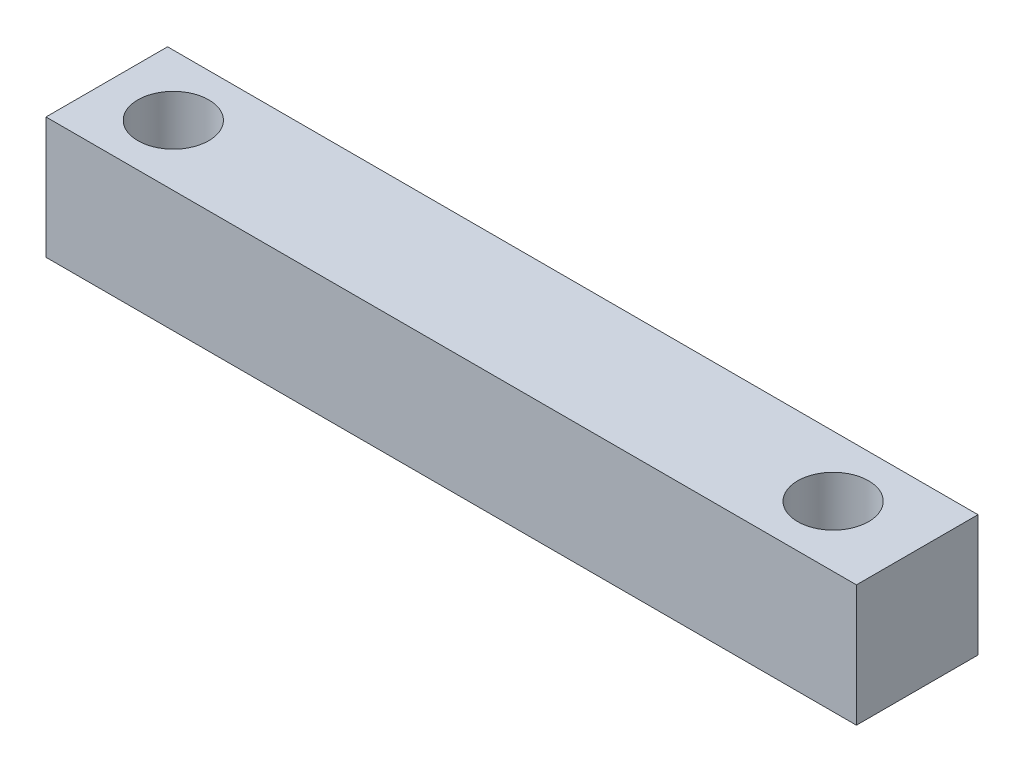
ISO-10303-21;
HEADER;
FILE_DESCRIPTION(('STEP AP214'),'2;1');
FILE_NAME('part.step','',(''),(''),'','','');
FILE_SCHEMA(('AUTOMOTIVE_DESIGN { 1 0 10303 214 1 1 1 1 }'));
ENDSEC;
DATA;
#1=APPLICATION_CONTEXT('core data for automotive mechanical design processes');
#2=APPLICATION_PROTOCOL_DEFINITION('international standard','automotive_design',2000,#1);
#3=PRODUCT_CONTEXT('',#1,'mechanical');
#4=PRODUCT('Part','Part','',(#3));
#5=PRODUCT_RELATED_PRODUCT_CATEGORY('part','',(#4));
#6=PRODUCT_DEFINITION_FORMATION('','',#4);
#7=PRODUCT_DEFINITION_CONTEXT('part definition',#1,'design');
#8=PRODUCT_DEFINITION('design','',#6,#7);
#9=PRODUCT_DEFINITION_SHAPE('','',#8);
#10=(LENGTH_UNIT() NAMED_UNIT(*) SI_UNIT(.MILLI.,.METRE.));
#11=(NAMED_UNIT(*) PLANE_ANGLE_UNIT() SI_UNIT($,.RADIAN.));
#12=(NAMED_UNIT(*) SI_UNIT($,.STERADIAN.) SOLID_ANGLE_UNIT());
#13=UNCERTAINTY_MEASURE_WITH_UNIT(LENGTH_MEASURE(1.E-05),#10,'distance_accuracy_value','');
#14=(GEOMETRIC_REPRESENTATION_CONTEXT(3) GLOBAL_UNCERTAINTY_ASSIGNED_CONTEXT((#13)) GLOBAL_UNIT_ASSIGNED_CONTEXT((#10,
#11,#12)) REPRESENTATION_CONTEXT('',''));
#15=CARTESIAN_POINT('',(0.,0.,0.));
#16=DIRECTION('',(0.,0.,1.));
#17=DIRECTION('',(1.,0.,0.));
#18=AXIS2_PLACEMENT_3D('',#15,#16,#17);
#19=CARTESIAN_POINT('',(0.,10.,0.));
#20=DIRECTION('',(1.,0.,0.));
#21=DIRECTION('',(0.,0.,-1.));
#22=AXIS2_PLACEMENT_3D('',#19,#20,#21);
#23=PLANE('',#22);
#24=DIRECTION('',(0.,0.,1.));
#25=VECTOR('',#24,1.);
#26=CARTESIAN_POINT('',(0.,0.,0.));
#27=LINE('',#26,#25);
#28=CARTESIAN_POINT('',(0.,0.,-6.));
#29=VERTEX_POINT('',#28);
#30=CARTESIAN_POINT('',(0.,0.,0.));
#31=VERTEX_POINT('',#30);
#32=EDGE_CURVE('E90',#29,#31,#27,.T.);
#33=ORIENTED_EDGE('',*,*,#32,.T.);
#34=DIRECTION('',(0.,-1.,0.));
#35=VECTOR('',#34,1.);
#36=CARTESIAN_POINT('',(0.,10.,0.));
#37=LINE('',#36,#35);
#38=CARTESIAN_POINT('',(0.,6.,0.));
#39=VERTEX_POINT('',#38);
#40=EDGE_CURVE('E12',#39,#31,#37,.T.);
#41=ORIENTED_EDGE('',*,*,#40,.F.);
#42=DIRECTION('',(0.,0.,1.));
#43=VECTOR('',#42,1.);
#44=CARTESIAN_POINT('',(0.,6.,0.));
#45=LINE('',#44,#43);
#46=CARTESIAN_POINT('',(0.,6.,-6.));
#47=VERTEX_POINT('',#46);
#48=EDGE_CURVE('E107',#47,#39,#45,.T.);
#49=ORIENTED_EDGE('',*,*,#48,.F.);
#50=DIRECTION('',(0.,-1.,0.));
#51=VECTOR('',#50,1.);
#52=CARTESIAN_POINT('',(0.,10.,-6.));
#53=LINE('',#52,#51);
#54=EDGE_CURVE('E96',#47,#29,#53,.T.);
#55=ORIENTED_EDGE('',*,*,#54,.T.);
#56=EDGE_LOOP('',(#33,#41,#49,#55));
#57=FACE_BOUND('',#56,.T.);
#58=ADVANCED_FACE('F36',(#57),#23,.F.);
#59=CARTESIAN_POINT('',(0.,10.,0.));
#60=DIRECTION('',(0.,0.,-1.));
#61=DIRECTION('',(-1.,0.,0.));
#62=AXIS2_PLACEMENT_3D('',#59,#60,#61);
#63=PLANE('',#62);
#64=DIRECTION('',(1.,0.,0.));
#65=VECTOR('',#64,1.);
#66=CARTESIAN_POINT('',(0.,0.,0.));
#67=LINE('',#66,#65);
#68=CARTESIAN_POINT('',(40.,0.,0.));
#69=VERTEX_POINT('',#68);
#70=EDGE_CURVE('E87',#31,#69,#67,.T.);
#71=ORIENTED_EDGE('',*,*,#70,.T.);
#72=DIRECTION('',(0.,-1.,0.));
#73=VECTOR('',#72,1.);
#74=CARTESIAN_POINT('',(40.,10.,0.));
#75=LINE('',#74,#73);
#76=CARTESIAN_POINT('',(40.,6.,0.));
#77=VERTEX_POINT('',#76);
#78=EDGE_CURVE('E46',#77,#69,#75,.T.);
#79=ORIENTED_EDGE('',*,*,#78,.F.);
#80=DIRECTION('',(1.,0.,0.));
#81=VECTOR('',#80,1.);
#82=CARTESIAN_POINT('',(0.,6.,0.));
#83=LINE('',#82,#81);
#84=EDGE_CURVE('E40',#39,#77,#83,.T.);
#85=ORIENTED_EDGE('',*,*,#84,.F.);
#86=ORIENTED_EDGE('',*,*,#40,.T.);
#87=EDGE_LOOP('',(#71,#79,#85,#86));
#88=FACE_BOUND('',#87,.T.);
#89=ADVANCED_FACE('F93',(#88),#63,.F.);
#90=CARTESIAN_POINT('',(40.,10.,0.));
#91=DIRECTION('',(-1.,0.,0.));
#92=DIRECTION('',(0.,0.,1.));
#93=AXIS2_PLACEMENT_3D('',#90,#91,#92);
#94=PLANE('',#93);
#95=DIRECTION('',(0.,0.,-1.));
#96=VECTOR('',#95,1.);
#97=CARTESIAN_POINT('',(40.,0.,0.));
#98=LINE('',#97,#96);
#99=CARTESIAN_POINT('',(40.,0.,-6.));
#100=VERTEX_POINT('',#99);
#101=EDGE_CURVE('E79',#69,#100,#98,.T.);
#102=ORIENTED_EDGE('',*,*,#101,.T.);
#103=DIRECTION('',(0.,-1.,0.));
#104=VECTOR('',#103,1.);
#105=CARTESIAN_POINT('',(40.,10.,-6.));
#106=LINE('',#105,#104);
#107=CARTESIAN_POINT('',(40.,6.,-6.));
#108=VERTEX_POINT('',#107);
#109=EDGE_CURVE('E109',#108,#100,#106,.T.);
#110=ORIENTED_EDGE('',*,*,#109,.F.);
#111=DIRECTION('',(0.,0.,-1.));
#112=VECTOR('',#111,1.);
#113=CARTESIAN_POINT('',(40.,6.,0.));
#114=LINE('',#113,#112);
#115=EDGE_CURVE('E118',#77,#108,#114,.T.);
#116=ORIENTED_EDGE('',*,*,#115,.F.);
#117=ORIENTED_EDGE('',*,*,#78,.T.);
#118=EDGE_LOOP('',(#102,#110,#116,#117));
#119=FACE_BOUND('',#118,.T.);
#120=ADVANCED_FACE('F120',(#119),#94,.F.);
#121=CARTESIAN_POINT('',(0.,10.,-6.));
#122=DIRECTION('',(0.,0.,1.));
#123=DIRECTION('',(1.,0.,0.));
#124=AXIS2_PLACEMENT_3D('',#121,#122,#123);
#125=PLANE('',#124);
#126=DIRECTION('',(-1.,0.,0.));
#127=VECTOR('',#126,1.);
#128=CARTESIAN_POINT('',(0.,0.,-6.));
#129=LINE('',#128,#127);
#130=EDGE_CURVE('E71',#100,#29,#129,.T.);
#131=ORIENTED_EDGE('',*,*,#130,.T.);
#132=ORIENTED_EDGE('',*,*,#54,.F.);
#133=DIRECTION('',(-1.,0.,0.));
#134=VECTOR('',#133,1.);
#135=CARTESIAN_POINT('',(0.,6.,-6.));
#136=LINE('',#135,#134);
#137=EDGE_CURVE('E55',#108,#47,#136,.T.);
#138=ORIENTED_EDGE('',*,*,#137,.F.);
#139=ORIENTED_EDGE('',*,*,#109,.T.);
#140=EDGE_LOOP('',(#131,#132,#138,#139));
#141=FACE_BOUND('',#140,.T.);
#142=ADVANCED_FACE('F121',(#141),#125,.F.);
#143=CARTESIAN_POINT('',(0.,6.,0.));
#144=DIRECTION('',(0.,-1.,0.));
#145=DIRECTION('',(0.,0.,-1.));
#146=AXIS2_PLACEMENT_3D('',#143,#144,#145);
#147=PLANE('',#146);
#148=CARTESIAN_POINT('',(35.85,6.,-3.));
#149=DIRECTION('',(0.,-1.,0.));
#150=DIRECTION('',(0.,0.,-1.));
#151=AXIS2_PLACEMENT_3D('',#148,#149,#150);
#152=CIRCLE('',#151,1.75);
#153=CARTESIAN_POINT('',(35.85,6.,-4.75));
#154=VERTEX_POINT('',#153);
#155=EDGE_CURVE('E100',#154,#154,#152,.F.);
#156=ORIENTED_EDGE('',*,*,#155,.F.);
#157=EDGE_LOOP('',(#156));
#158=FACE_BOUND('',#157,.T.);
#159=CARTESIAN_POINT('',(3.28320942009989,6.,-3.));
#160=DIRECTION('',(0.,-1.,0.));
#161=DIRECTION('',(0.,0.,-1.));
#162=AXIS2_PLACEMENT_3D('',#159,#160,#161);
#163=CIRCLE('',#162,1.75);
#164=CARTESIAN_POINT('',(3.28320942009989,6.,-4.75));
#165=VERTEX_POINT('',#164);
#166=EDGE_CURVE('E114',#165,#165,#163,.F.);
#167=ORIENTED_EDGE('',*,*,#166,.F.);
#168=EDGE_LOOP('',(#167));
#169=FACE_BOUND('',#168,.T.);
#170=ORIENTED_EDGE('',*,*,#48,.T.);
#171=ORIENTED_EDGE('',*,*,#84,.T.);
#172=ORIENTED_EDGE('',*,*,#115,.T.);
#173=ORIENTED_EDGE('',*,*,#137,.T.);
#174=EDGE_LOOP('',(#170,#171,#172,#173));
#175=FACE_BOUND('',#174,.T.);
#176=ADVANCED_FACE('F38',(#158,#169,#175),#147,.F.);
#177=CARTESIAN_POINT('',(0.,0.,0.));
#178=DIRECTION('',(0.,-1.,0.));
#179=DIRECTION('',(0.,0.,-1.));
#180=AXIS2_PLACEMENT_3D('',#177,#178,#179);
#181=PLANE('',#180);
#182=CARTESIAN_POINT('',(35.85,0.,-3.));
#183=DIRECTION('',(0.,1.,0.));
#184=DIRECTION('',(0.,0.,1.));
#185=AXIS2_PLACEMENT_3D('',#182,#183,#184);
#186=CIRCLE('',#185,1.75);
#187=CARTESIAN_POINT('',(35.85,0.,-1.24999999999999));
#188=VERTEX_POINT('',#187);
#189=EDGE_CURVE('E97',#188,#188,#186,.T.);
#190=ORIENTED_EDGE('',*,*,#189,.T.);
#191=EDGE_LOOP('',(#190));
#192=FACE_BOUND('',#191,.T.);
#193=CARTESIAN_POINT('',(3.28320942009989,0.,-3.));
#194=DIRECTION('',(0.,1.,0.));
#195=DIRECTION('',(0.,0.,1.));
#196=AXIS2_PLACEMENT_3D('',#193,#194,#195);
#197=CIRCLE('',#196,1.75);
#198=CARTESIAN_POINT('',(3.28320942009989,0.,-1.24999999999999));
#199=VERTEX_POINT('',#198);
#200=EDGE_CURVE('E103',#199,#199,#197,.T.);
#201=ORIENTED_EDGE('',*,*,#200,.T.);
#202=EDGE_LOOP('',(#201));
#203=FACE_BOUND('',#202,.T.);
#204=ORIENTED_EDGE('',*,*,#32,.F.);
#205=ORIENTED_EDGE('',*,*,#130,.F.);
#206=ORIENTED_EDGE('',*,*,#101,.F.);
#207=ORIENTED_EDGE('',*,*,#70,.F.);
#208=EDGE_LOOP('',(#204,#205,#206,#207));
#209=FACE_BOUND('',#208,.T.);
#210=ADVANCED_FACE('F88',(#192,#203,#209),#181,.T.);
#211=CARTESIAN_POINT('',(3.28320942009989,0.,-3.));
#212=DIRECTION('',(0.,1.,0.));
#213=DIRECTION('',(0.,0.,1.));
#214=AXIS2_PLACEMENT_3D('',#211,#212,#213);
#215=CYLINDRICAL_SURFACE('',#214,1.75);
#216=ORIENTED_EDGE('',*,*,#200,.F.);
#217=EDGE_LOOP('',(#216));
#218=FACE_BOUND('',#217,.T.);
#219=ORIENTED_EDGE('',*,*,#166,.T.);
#220=EDGE_LOOP('',(#219));
#221=FACE_BOUND('',#220,.T.);
#222=ADVANCED_FACE('F159',(#218,#221),#215,.F.);
#223=CARTESIAN_POINT('',(35.85,0.,-3.));
#224=DIRECTION('',(0.,1.,0.));
#225=DIRECTION('',(0.,0.,1.));
#226=AXIS2_PLACEMENT_3D('',#223,#224,#225);
#227=CYLINDRICAL_SURFACE('',#226,1.75);
#228=ORIENTED_EDGE('',*,*,#189,.F.);
#229=EDGE_LOOP('',(#228));
#230=FACE_BOUND('',#229,.T.);
#231=ORIENTED_EDGE('',*,*,#155,.T.);
#232=EDGE_LOOP('',(#231));
#233=FACE_BOUND('',#232,.T.);
#234=ADVANCED_FACE('F164',(#230,#233),#227,.F.);
#235=CLOSED_SHELL('',(#58,#89,#120,#142,#176,#210,#222,#234));
#236=MANIFOLD_SOLID_BREP('B2',#235);
#237=ADVANCED_BREP_SHAPE_REPRESENTATION('',(#18,#236),#14);
#238=SHAPE_DEFINITION_REPRESENTATION(#9,#237);
ENDSEC;
END-ISO-10303-21;
